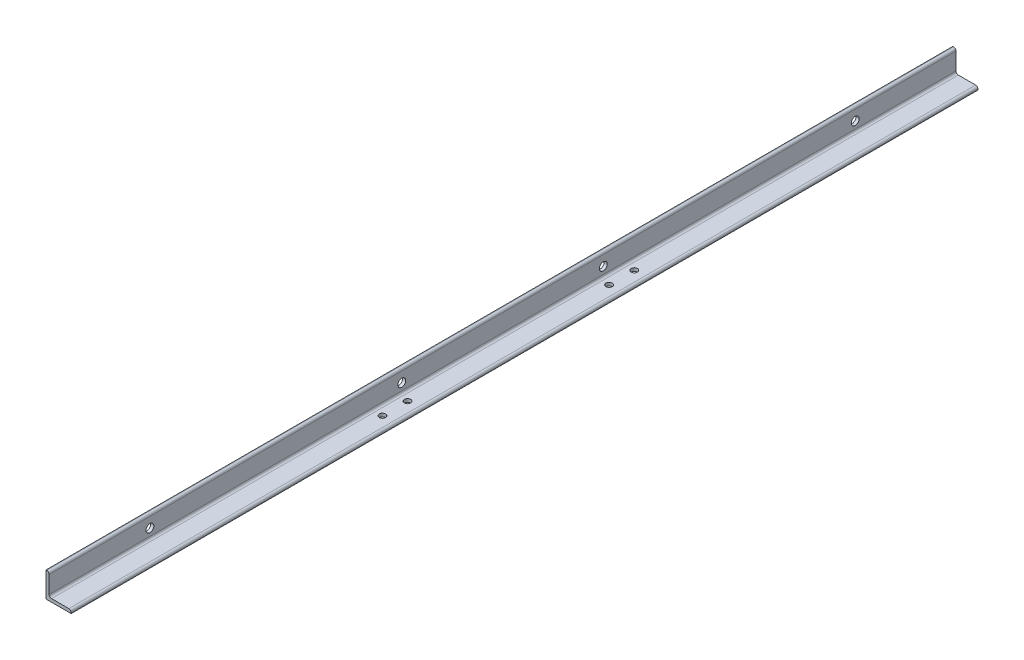
ISO-10303-21;
HEADER;
FILE_DESCRIPTION(('STEP AP214'),'2;1');
FILE_NAME('part.step','',(''),(''),'','','');
FILE_SCHEMA(('AUTOMOTIVE_DESIGN { 1 0 10303 214 1 1 1 1 }'));
ENDSEC;
DATA;
#1=APPLICATION_CONTEXT('core data for automotive mechanical design processes');
#2=APPLICATION_PROTOCOL_DEFINITION('international standard','automotive_design',2000,#1);
#3=PRODUCT_CONTEXT('',#1,'mechanical');
#4=PRODUCT('Part','Part','',(#3));
#5=PRODUCT_RELATED_PRODUCT_CATEGORY('part','',(#4));
#6=PRODUCT_DEFINITION_FORMATION('','',#4);
#7=PRODUCT_DEFINITION_CONTEXT('part definition',#1,'design');
#8=PRODUCT_DEFINITION('design','',#6,#7);
#9=PRODUCT_DEFINITION_SHAPE('','',#8);
#10=(LENGTH_UNIT() NAMED_UNIT(*) SI_UNIT(.MILLI.,.METRE.));
#11=(NAMED_UNIT(*) PLANE_ANGLE_UNIT() SI_UNIT($,.RADIAN.));
#12=(NAMED_UNIT(*) SI_UNIT($,.STERADIAN.) SOLID_ANGLE_UNIT());
#13=UNCERTAINTY_MEASURE_WITH_UNIT(LENGTH_MEASURE(1.E-05),#10,'distance_accuracy_value','');
#14=(GEOMETRIC_REPRESENTATION_CONTEXT(3) GLOBAL_UNCERTAINTY_ASSIGNED_CONTEXT((#13)) GLOBAL_UNIT_ASSIGNED_CONTEXT((#10,
#11,#12)) REPRESENTATION_CONTEXT('',''));
#15=CARTESIAN_POINT('',(0.,0.,0.));
#16=DIRECTION('',(0.,0.,1.));
#17=DIRECTION('',(1.,0.,0.));
#18=AXIS2_PLACEMENT_3D('',#15,#16,#17);
#19=CARTESIAN_POINT('',(0.,0.,914.4));
#20=DIRECTION('',(1.,0.,0.));
#21=DIRECTION('',(0.,1.,0.));
#22=AXIS2_PLACEMENT_3D('',#19,#20,#21);
#23=PLANE('',#22);
#24=CARTESIAN_POINT('',(0.,25.4,711.2));
#25=DIRECTION('',(-1.,0.,0.));
#26=DIRECTION('',(0.,0.,1.));
#27=AXIS2_PLACEMENT_3D('',#24,#25,#26);
#28=CIRCLE('',#27,7.93749999999999);
#29=CARTESIAN_POINT('',(0.,25.4,719.1375));
#30=VERTEX_POINT('',#29);
#31=EDGE_CURVE('E210',#30,#30,#28,.T.);
#32=ORIENTED_EDGE('',*,*,#31,.F.);
#33=EDGE_LOOP('',(#32));
#34=FACE_BOUND('',#33,.T.);
#35=DIRECTION('',(0.,-1.,0.));
#36=VECTOR('',#35,1.);
#37=CARTESIAN_POINT('',(0.,0.,-914.4));
#38=LINE('',#37,#36);
#39=CARTESIAN_POINT('',(0.,50.8,-914.4));
#40=VERTEX_POINT('',#39);
#41=CARTESIAN_POINT('',(0.,0.,-914.4));
#42=VERTEX_POINT('',#41);
#43=EDGE_CURVE('E90',#40,#42,#38,.T.);
#44=ORIENTED_EDGE('',*,*,#43,.T.);
#45=DIRECTION('',(0.,0.,-1.));
#46=VECTOR('',#45,1.);
#47=CARTESIAN_POINT('',(0.,0.,914.4));
#48=LINE('',#47,#46);
#49=CARTESIAN_POINT('',(0.,0.,914.4));
#50=VERTEX_POINT('',#49);
#51=EDGE_CURVE('E134',#50,#42,#48,.T.);
#52=ORIENTED_EDGE('',*,*,#51,.F.);
#53=DIRECTION('',(0.,-1.,0.));
#54=VECTOR('',#53,1.);
#55=CARTESIAN_POINT('',(0.,0.,914.4));
#56=LINE('',#55,#54);
#57=CARTESIAN_POINT('',(0.,50.8,914.4));
#58=VERTEX_POINT('',#57);
#59=EDGE_CURVE('E52',#58,#50,#56,.T.);
#60=ORIENTED_EDGE('',*,*,#59,.F.);
#61=DIRECTION('',(0.,0.,-1.));
#62=VECTOR('',#61,1.);
#63=CARTESIAN_POINT('',(0.,50.8,914.4));
#64=LINE('',#63,#62);
#65=EDGE_CURVE('E130',#58,#40,#64,.T.);
#66=ORIENTED_EDGE('',*,*,#65,.T.);
#67=EDGE_LOOP('',(#44,#52,#60,#66));
#68=FACE_BOUND('',#67,.T.);
#69=CARTESIAN_POINT('',(0.,25.4,203.2));
#70=DIRECTION('',(-1.,0.,0.));
#71=DIRECTION('',(0.,0.,1.));
#72=AXIS2_PLACEMENT_3D('',#69,#70,#71);
#73=CIRCLE('',#72,7.93749999999999);
#74=CARTESIAN_POINT('',(0.,25.4,211.1375));
#75=VERTEX_POINT('',#74);
#76=EDGE_CURVE('E216',#75,#75,#73,.T.);
#77=ORIENTED_EDGE('',*,*,#76,.F.);
#78=EDGE_LOOP('',(#77));
#79=FACE_BOUND('',#78,.T.);
#80=CARTESIAN_POINT('',(0.,25.4,-203.2));
#81=DIRECTION('',(-1.,0.,0.));
#82=DIRECTION('',(0.,0.,1.));
#83=AXIS2_PLACEMENT_3D('',#80,#81,#82);
#84=CIRCLE('',#83,7.93749999999999);
#85=CARTESIAN_POINT('',(0.,25.4,-195.2625));
#86=VERTEX_POINT('',#85);
#87=EDGE_CURVE('E222',#86,#86,#84,.T.);
#88=ORIENTED_EDGE('',*,*,#87,.F.);
#89=EDGE_LOOP('',(#88));
#90=FACE_BOUND('',#89,.T.);
#91=CARTESIAN_POINT('',(0.,25.4,-711.2));
#92=DIRECTION('',(-1.,0.,0.));
#93=DIRECTION('',(0.,0.,1.));
#94=AXIS2_PLACEMENT_3D('',#91,#92,#93);
#95=CIRCLE('',#94,7.93749999999999);
#96=CARTESIAN_POINT('',(0.,25.4,-703.2625));
#97=VERTEX_POINT('',#96);
#98=EDGE_CURVE('E228',#97,#97,#95,.T.);
#99=ORIENTED_EDGE('',*,*,#98,.F.);
#100=EDGE_LOOP('',(#99));
#101=FACE_BOUND('',#100,.T.);
#102=ADVANCED_FACE('F35',(#34,#68,#79,#90,#101),#23,.F.);
#103=CARTESIAN_POINT('',(50.7999999999999,0.,914.4));
#104=DIRECTION('',(0.,1.,0.));
#105=DIRECTION('',(0.,0.,1.));
#106=AXIS2_PLACEMENT_3D('',#103,#104,#105);
#107=PLANE('',#106);
#108=CARTESIAN_POINT('',(25.4,0.,261.366));
#109=DIRECTION('',(0.,1.,0.));
#110=DIRECTION('',(0.,0.,1.));
#111=AXIS2_PLACEMENT_3D('',#108,#109,#110);
#112=CIRCLE('',#111,6.35);
#113=CARTESIAN_POINT('',(25.4,0.,267.716));
#114=VERTEX_POINT('',#113);
#115=EDGE_CURVE('E235',#114,#114,#112,.T.);
#116=ORIENTED_EDGE('',*,*,#115,.T.);
#117=EDGE_LOOP('',(#116));
#118=FACE_BOUND('',#117,.T.);
#119=CARTESIAN_POINT('',(25.4,0.,-246.634));
#120=DIRECTION('',(0.,1.,0.));
#121=DIRECTION('',(0.,0.,1.));
#122=AXIS2_PLACEMENT_3D('',#119,#120,#121);
#123=CIRCLE('',#122,6.35);
#124=CARTESIAN_POINT('',(25.4,0.,-240.284));
#125=VERTEX_POINT('',#124);
#126=EDGE_CURVE('E231',#125,#125,#123,.T.);
#127=ORIENTED_EDGE('',*,*,#126,.T.);
#128=EDGE_LOOP('',(#127));
#129=FACE_BOUND('',#128,.T.);
#130=CARTESIAN_POINT('',(25.4,0.,-195.834));
#131=DIRECTION('',(0.,-1.,0.));
#132=DIRECTION('',(0.,0.,-1.));
#133=AXIS2_PLACEMENT_3D('',#130,#131,#132);
#134=CIRCLE('',#133,6.35);
#135=CARTESIAN_POINT('',(25.4,0.,-202.184));
#136=VERTEX_POINT('',#135);
#137=EDGE_CURVE('E204',#136,#136,#134,.T.);
#138=ORIENTED_EDGE('',*,*,#137,.F.);
#139=EDGE_LOOP('',(#138));
#140=FACE_BOUND('',#139,.T.);
#141=CARTESIAN_POINT('',(25.4,0.,210.566));
#142=DIRECTION('',(0.,-1.,0.));
#143=DIRECTION('',(0.,0.,-1.));
#144=AXIS2_PLACEMENT_3D('',#141,#142,#143);
#145=CIRCLE('',#144,6.35);
#146=CARTESIAN_POINT('',(25.4,0.,204.216));
#147=VERTEX_POINT('',#146);
#148=EDGE_CURVE('E198',#147,#147,#145,.T.);
#149=ORIENTED_EDGE('',*,*,#148,.F.);
#150=EDGE_LOOP('',(#149));
#151=FACE_BOUND('',#150,.T.);
#152=DIRECTION('',(1.,0.,0.));
#153=VECTOR('',#152,1.);
#154=CARTESIAN_POINT('',(50.7999999999999,0.,-914.4));
#155=LINE('',#154,#153);
#156=CARTESIAN_POINT('',(50.7999999999999,0.,-914.4));
#157=VERTEX_POINT('',#156);
#158=EDGE_CURVE('E138',#42,#157,#155,.T.);
#159=ORIENTED_EDGE('',*,*,#158,.T.);
#160=DIRECTION('',(0.,0.,-1.));
#161=VECTOR('',#160,1.);
#162=CARTESIAN_POINT('',(50.7999999999999,0.,914.4));
#163=LINE('',#162,#161);
#164=CARTESIAN_POINT('',(50.7999999999999,0.,914.4));
#165=VERTEX_POINT('',#164);
#166=EDGE_CURVE('E11',#165,#157,#163,.T.);
#167=ORIENTED_EDGE('',*,*,#166,.F.);
#168=DIRECTION('',(1.,0.,0.));
#169=VECTOR('',#168,1.);
#170=CARTESIAN_POINT('',(50.7999999999999,0.,914.4));
#171=LINE('',#170,#169);
#172=EDGE_CURVE('E155',#50,#165,#171,.T.);
#173=ORIENTED_EDGE('',*,*,#172,.F.);
#174=ORIENTED_EDGE('',*,*,#51,.T.);
#175=EDGE_LOOP('',(#159,#167,#173,#174));
#176=FACE_BOUND('',#175,.T.);
#177=ADVANCED_FACE('F37',(#118,#129,#140,#151,#176),#107,.F.);
#178=CARTESIAN_POINT('',(50.7999999999999,1.59258,914.4));
#179=DIRECTION('',(-1.,0.,0.));
#180=DIRECTION('',(0.,0.,1.));
#181=AXIS2_PLACEMENT_3D('',#178,#179,#180);
#182=PLANE('',#181);
#183=DIRECTION('',(0.,1.,0.));
#184=VECTOR('',#183,1.);
#185=CARTESIAN_POINT('',(50.7999999999999,1.59258,-914.4));
#186=LINE('',#185,#184);
#187=CARTESIAN_POINT('',(50.7999999999999,1.59258,-914.4));
#188=VERTEX_POINT('',#187);
#189=EDGE_CURVE('E141',#157,#188,#186,.T.);
#190=ORIENTED_EDGE('',*,*,#189,.T.);
#191=DIRECTION('',(0.,0.,-1.));
#192=VECTOR('',#191,1.);
#193=CARTESIAN_POINT('',(50.7999999999999,1.59258,914.4));
#194=LINE('',#193,#192);
#195=CARTESIAN_POINT('',(50.7999999999999,1.59258,914.4));
#196=VERTEX_POINT('',#195);
#197=EDGE_CURVE('E44',#196,#188,#194,.T.);
#198=ORIENTED_EDGE('',*,*,#197,.F.);
#199=DIRECTION('',(0.,1.,0.));
#200=VECTOR('',#199,1.);
#201=CARTESIAN_POINT('',(50.7999999999999,1.59258,914.4));
#202=LINE('',#201,#200);
#203=EDGE_CURVE('E98',#165,#196,#202,.T.);
#204=ORIENTED_EDGE('',*,*,#203,.F.);
#205=ORIENTED_EDGE('',*,*,#166,.T.);
#206=EDGE_LOOP('',(#190,#198,#204,#205));
#207=FACE_BOUND('',#206,.T.);
#208=ADVANCED_FACE('F271',(#207),#182,.F.);
#209=CARTESIAN_POINT('',(46.0425799999999,1.59258,914.4));
#210=DIRECTION('',(0.,0.,-1.));
#211=DIRECTION('',(-1.,0.,0.));
#212=AXIS2_PLACEMENT_3D('',#209,#210,#211);
#213=CYLINDRICAL_SURFACE('',#212,4.75742);
#214=CARTESIAN_POINT('',(46.0425799999999,1.59258,-914.4));
#215=DIRECTION('',(0.,0.,1.));
#216=DIRECTION('',(1.,0.,0.));
#217=AXIS2_PLACEMENT_3D('',#214,#215,#216);
#218=CIRCLE('',#217,4.75742);
#219=CARTESIAN_POINT('',(46.0425799999999,6.34999999999999,-914.4));
#220=VERTEX_POINT('',#219);
#221=EDGE_CURVE('E144',#188,#220,#218,.T.);
#222=ORIENTED_EDGE('',*,*,#221,.T.);
#223=DIRECTION('',(0.,0.,-1.));
#224=VECTOR('',#223,1.);
#225=CARTESIAN_POINT('',(46.0425799999999,6.34999999999999,914.4));
#226=LINE('',#225,#224);
#227=CARTESIAN_POINT('',(46.0425799999999,6.34999999999999,914.4));
#228=VERTEX_POINT('',#227);
#229=EDGE_CURVE('E165',#228,#220,#226,.T.);
#230=ORIENTED_EDGE('',*,*,#229,.F.);
#231=CARTESIAN_POINT('',(46.0425799999999,1.59258,914.4));
#232=DIRECTION('',(0.,0.,1.));
#233=DIRECTION('',(1.,0.,0.));
#234=AXIS2_PLACEMENT_3D('',#231,#232,#233);
#235=CIRCLE('',#234,4.75742);
#236=EDGE_CURVE('E173',#196,#228,#235,.T.);
#237=ORIENTED_EDGE('',*,*,#236,.F.);
#238=ORIENTED_EDGE('',*,*,#197,.T.);
#239=EDGE_LOOP('',(#222,#230,#237,#238));
#240=FACE_BOUND('',#239,.T.);
#241=ADVANCED_FACE('F171',(#240),#213,.T.);
#242=CARTESIAN_POINT('',(11.1125,6.34999999999999,914.4));
#243=DIRECTION('',(0.,-1.,0.));
#244=DIRECTION('',(0.,0.,-1.));
#245=AXIS2_PLACEMENT_3D('',#242,#243,#244);
#246=PLANE('',#245);
#247=CARTESIAN_POINT('',(25.4,6.34999999999999,261.366));
#248=DIRECTION('',(0.,1.,0.));
#249=DIRECTION('',(0.,0.,1.));
#250=AXIS2_PLACEMENT_3D('',#247,#248,#249);
#251=CIRCLE('',#250,6.35);
#252=CARTESIAN_POINT('',(25.4,6.34999999999999,267.716));
#253=VERTEX_POINT('',#252);
#254=EDGE_CURVE('E238',#253,#253,#251,.T.);
#255=ORIENTED_EDGE('',*,*,#254,.F.);
#256=EDGE_LOOP('',(#255));
#257=FACE_BOUND('',#256,.T.);
#258=CARTESIAN_POINT('',(25.4,6.34999999999999,-246.634));
#259=DIRECTION('',(0.,1.,0.));
#260=DIRECTION('',(0.,0.,1.));
#261=AXIS2_PLACEMENT_3D('',#258,#259,#260);
#262=CIRCLE('',#261,6.35);
#263=CARTESIAN_POINT('',(25.4,6.34999999999999,-240.284));
#264=VERTEX_POINT('',#263);
#265=EDGE_CURVE('E232',#264,#264,#262,.T.);
#266=ORIENTED_EDGE('',*,*,#265,.F.);
#267=EDGE_LOOP('',(#266));
#268=FACE_BOUND('',#267,.T.);
#269=CARTESIAN_POINT('',(25.4,6.34999999999999,-195.834));
#270=DIRECTION('',(0.,-1.,0.));
#271=DIRECTION('',(0.,0.,-1.));
#272=AXIS2_PLACEMENT_3D('',#269,#270,#271);
#273=CIRCLE('',#272,6.35);
#274=CARTESIAN_POINT('',(25.4,6.34999999999999,-202.184));
#275=VERTEX_POINT('',#274);
#276=EDGE_CURVE('E201',#275,#275,#273,.T.);
#277=ORIENTED_EDGE('',*,*,#276,.T.);
#278=EDGE_LOOP('',(#277));
#279=FACE_BOUND('',#278,.T.);
#280=CARTESIAN_POINT('',(25.4,6.34999999999999,210.566));
#281=DIRECTION('',(0.,-1.,0.));
#282=DIRECTION('',(0.,0.,-1.));
#283=AXIS2_PLACEMENT_3D('',#280,#281,#282);
#284=CIRCLE('',#283,6.35);
#285=CARTESIAN_POINT('',(25.4,6.34999999999999,204.216));
#286=VERTEX_POINT('',#285);
#287=EDGE_CURVE('E142',#286,#286,#284,.T.);
#288=ORIENTED_EDGE('',*,*,#287,.T.);
#289=EDGE_LOOP('',(#288));
#290=FACE_BOUND('',#289,.T.);
#291=DIRECTION('',(-1.,0.,0.));
#292=VECTOR('',#291,1.);
#293=CARTESIAN_POINT('',(11.1125,6.34999999999999,-914.4));
#294=LINE('',#293,#292);
#295=CARTESIAN_POINT('',(11.1125,6.34999999999999,-914.4));
#296=VERTEX_POINT('',#295);
#297=EDGE_CURVE('E146',#220,#296,#294,.T.);
#298=ORIENTED_EDGE('',*,*,#297,.T.);
#299=DIRECTION('',(0.,0.,-1.));
#300=VECTOR('',#299,1.);
#301=CARTESIAN_POINT('',(11.1125,6.34999999999999,914.4));
#302=LINE('',#301,#300);
#303=CARTESIAN_POINT('',(11.1125,6.34999999999999,914.4));
#304=VERTEX_POINT('',#303);
#305=EDGE_CURVE('E162',#304,#296,#302,.T.);
#306=ORIENTED_EDGE('',*,*,#305,.F.);
#307=DIRECTION('',(-1.,0.,0.));
#308=VECTOR('',#307,1.);
#309=CARTESIAN_POINT('',(11.1125,6.34999999999999,914.4));
#310=LINE('',#309,#308);
#311=EDGE_CURVE('E189',#228,#304,#310,.T.);
#312=ORIENTED_EDGE('',*,*,#311,.F.);
#313=ORIENTED_EDGE('',*,*,#229,.T.);
#314=EDGE_LOOP('',(#298,#306,#312,#313));
#315=FACE_BOUND('',#314,.T.);
#316=ADVANCED_FACE('F182',(#257,#268,#279,#290,#315),#246,.F.);
#317=CARTESIAN_POINT('',(11.1125,11.1125,914.4));
#318=DIRECTION('',(0.,0.,-1.));
#319=DIRECTION('',(-1.,0.,0.));
#320=AXIS2_PLACEMENT_3D('',#317,#318,#319);
#321=CYLINDRICAL_SURFACE('',#320,4.7625);
#322=CARTESIAN_POINT('',(11.1125,11.1125,-914.4));
#323=DIRECTION('',(0.,0.,-1.));
#324=DIRECTION('',(-1.,0.,0.));
#325=AXIS2_PLACEMENT_3D('',#322,#323,#324);
#326=CIRCLE('',#325,4.7625);
#327=CARTESIAN_POINT('',(6.35,11.1125,-914.4));
#328=VERTEX_POINT('',#327);
#329=EDGE_CURVE('E148',#296,#328,#326,.T.);
#330=ORIENTED_EDGE('',*,*,#329,.T.);
#331=DIRECTION('',(0.,0.,-1.));
#332=VECTOR('',#331,1.);
#333=CARTESIAN_POINT('',(6.35,11.1125,914.4));
#334=LINE('',#333,#332);
#335=CARTESIAN_POINT('',(6.35,11.1125,914.4));
#336=VERTEX_POINT('',#335);
#337=EDGE_CURVE('E159',#336,#328,#334,.T.);
#338=ORIENTED_EDGE('',*,*,#337,.F.);
#339=CARTESIAN_POINT('',(11.1125,11.1125,914.4));
#340=DIRECTION('',(0.,0.,-1.));
#341=DIRECTION('',(-1.,0.,0.));
#342=AXIS2_PLACEMENT_3D('',#339,#340,#341);
#343=CIRCLE('',#342,4.7625);
#344=EDGE_CURVE('E188',#304,#336,#343,.T.);
#345=ORIENTED_EDGE('',*,*,#344,.F.);
#346=ORIENTED_EDGE('',*,*,#305,.T.);
#347=EDGE_LOOP('',(#330,#338,#345,#346));
#348=FACE_BOUND('',#347,.T.);
#349=ADVANCED_FACE('F186',(#348),#321,.F.);
#350=CARTESIAN_POINT('',(6.35,46.04258,914.4));
#351=DIRECTION('',(-1.,0.,0.));
#352=DIRECTION('',(0.,-1.,0.));
#353=AXIS2_PLACEMENT_3D('',#350,#351,#352);
#354=PLANE('',#353);
#355=CARTESIAN_POINT('',(6.35,25.4,-711.2));
#356=DIRECTION('',(-1.,0.,0.));
#357=DIRECTION('',(0.,-1.,0.));
#358=AXIS2_PLACEMENT_3D('',#355,#356,#357);
#359=CIRCLE('',#358,7.93749999999999);
#360=CARTESIAN_POINT('',(6.35,17.4625,-711.2));
#361=VERTEX_POINT('',#360);
#362=EDGE_CURVE('E225',#361,#361,#359,.T.);
#363=ORIENTED_EDGE('',*,*,#362,.T.);
#364=EDGE_LOOP('',(#363));
#365=FACE_BOUND('',#364,.T.);
#366=CARTESIAN_POINT('',(6.35,25.4,-203.2));
#367=DIRECTION('',(-1.,0.,0.));
#368=DIRECTION('',(0.,-1.,0.));
#369=AXIS2_PLACEMENT_3D('',#366,#367,#368);
#370=CIRCLE('',#369,7.93749999999999);
#371=CARTESIAN_POINT('',(6.35,17.4625,-203.2));
#372=VERTEX_POINT('',#371);
#373=EDGE_CURVE('E219',#372,#372,#370,.T.);
#374=ORIENTED_EDGE('',*,*,#373,.T.);
#375=EDGE_LOOP('',(#374));
#376=FACE_BOUND('',#375,.T.);
#377=CARTESIAN_POINT('',(6.35,25.4,203.2));
#378=DIRECTION('',(-1.,0.,0.));
#379=DIRECTION('',(0.,-1.,0.));
#380=AXIS2_PLACEMENT_3D('',#377,#378,#379);
#381=CIRCLE('',#380,7.93749999999999);
#382=CARTESIAN_POINT('',(6.35,17.4625,203.2));
#383=VERTEX_POINT('',#382);
#384=EDGE_CURVE('E213',#383,#383,#381,.T.);
#385=ORIENTED_EDGE('',*,*,#384,.T.);
#386=EDGE_LOOP('',(#385));
#387=FACE_BOUND('',#386,.T.);
#388=CARTESIAN_POINT('',(6.35,25.4,711.2));
#389=DIRECTION('',(-1.,0.,0.));
#390=DIRECTION('',(0.,-1.,0.));
#391=AXIS2_PLACEMENT_3D('',#388,#389,#390);
#392=CIRCLE('',#391,7.93749999999999);
#393=CARTESIAN_POINT('',(6.35,17.4625,711.2));
#394=VERTEX_POINT('',#393);
#395=EDGE_CURVE('E207',#394,#394,#392,.T.);
#396=ORIENTED_EDGE('',*,*,#395,.T.);
#397=EDGE_LOOP('',(#396));
#398=FACE_BOUND('',#397,.T.);
#399=DIRECTION('',(0.,1.,0.));
#400=VECTOR('',#399,1.);
#401=CARTESIAN_POINT('',(6.35,46.04258,-914.4));
#402=LINE('',#401,#400);
#403=CARTESIAN_POINT('',(6.35,46.04258,-914.4));
#404=VERTEX_POINT('',#403);
#405=EDGE_CURVE('E150',#328,#404,#402,.T.);
#406=ORIENTED_EDGE('',*,*,#405,.T.);
#407=DIRECTION('',(0.,0.,-1.));
#408=VECTOR('',#407,1.);
#409=CARTESIAN_POINT('',(6.35,46.04258,914.4));
#410=LINE('',#409,#408);
#411=CARTESIAN_POINT('',(6.35,46.04258,914.4));
#412=VERTEX_POINT('',#411);
#413=EDGE_CURVE('E129',#412,#404,#410,.T.);
#414=ORIENTED_EDGE('',*,*,#413,.F.);
#415=DIRECTION('',(0.,1.,0.));
#416=VECTOR('',#415,1.);
#417=CARTESIAN_POINT('',(6.35,46.04258,914.4));
#418=LINE('',#417,#416);
#419=EDGE_CURVE('E120',#336,#412,#418,.T.);
#420=ORIENTED_EDGE('',*,*,#419,.F.);
#421=ORIENTED_EDGE('',*,*,#337,.T.);
#422=EDGE_LOOP('',(#406,#414,#420,#421));
#423=FACE_BOUND('',#422,.T.);
#424=ADVANCED_FACE('F275',(#365,#376,#387,#398,#423),#354,.F.);
#425=CARTESIAN_POINT('',(1.59258,46.04258,914.4));
#426=DIRECTION('',(0.,0.,-1.));
#427=DIRECTION('',(-1.,0.,0.));
#428=AXIS2_PLACEMENT_3D('',#425,#426,#427);
#429=CYLINDRICAL_SURFACE('',#428,4.75742);
#430=CARTESIAN_POINT('',(1.59258,46.04258,-914.4));
#431=DIRECTION('',(0.,0.,1.));
#432=DIRECTION('',(-1.,0.,0.));
#433=AXIS2_PLACEMENT_3D('',#430,#431,#432);
#434=CIRCLE('',#433,4.75742);
#435=CARTESIAN_POINT('',(1.59258,50.8,-914.4));
#436=VERTEX_POINT('',#435);
#437=EDGE_CURVE('E128',#404,#436,#434,.T.);
#438=ORIENTED_EDGE('',*,*,#437,.T.);
#439=DIRECTION('',(0.,0.,-1.));
#440=VECTOR('',#439,1.);
#441=CARTESIAN_POINT('',(1.59258,50.8,914.4));
#442=LINE('',#441,#440);
#443=CARTESIAN_POINT('',(1.59258,50.8,914.4));
#444=VERTEX_POINT('',#443);
#445=EDGE_CURVE('E125',#444,#436,#442,.T.);
#446=ORIENTED_EDGE('',*,*,#445,.F.);
#447=CARTESIAN_POINT('',(1.59258,46.04258,914.4));
#448=DIRECTION('',(0.,0.,1.));
#449=DIRECTION('',(-1.,0.,0.));
#450=AXIS2_PLACEMENT_3D('',#447,#448,#449);
#451=CIRCLE('',#450,4.75742);
#452=EDGE_CURVE('E114',#412,#444,#451,.T.);
#453=ORIENTED_EDGE('',*,*,#452,.F.);
#454=ORIENTED_EDGE('',*,*,#413,.T.);
#455=EDGE_LOOP('',(#438,#446,#453,#454));
#456=FACE_BOUND('',#455,.T.);
#457=ADVANCED_FACE('F126',(#456),#429,.T.);
#458=CARTESIAN_POINT('',(0.,50.8,914.4));
#459=DIRECTION('',(0.,-1.,0.));
#460=DIRECTION('',(0.,0.,-1.));
#461=AXIS2_PLACEMENT_3D('',#458,#459,#460);
#462=PLANE('',#461);
#463=DIRECTION('',(-1.,0.,0.));
#464=VECTOR('',#463,1.);
#465=CARTESIAN_POINT('',(0.,50.8,-914.4));
#466=LINE('',#465,#464);
#467=EDGE_CURVE('E84',#436,#40,#466,.T.);
#468=ORIENTED_EDGE('',*,*,#467,.T.);
#469=ORIENTED_EDGE('',*,*,#65,.F.);
#470=DIRECTION('',(-1.,0.,0.));
#471=VECTOR('',#470,1.);
#472=CARTESIAN_POINT('',(0.,50.8,914.4));
#473=LINE('',#472,#471);
#474=EDGE_CURVE('E118',#444,#58,#473,.T.);
#475=ORIENTED_EDGE('',*,*,#474,.F.);
#476=ORIENTED_EDGE('',*,*,#445,.T.);
#477=EDGE_LOOP('',(#468,#469,#475,#476));
#478=FACE_BOUND('',#477,.T.);
#479=ADVANCED_FACE('F132',(#478),#462,.F.);
#480=CARTESIAN_POINT('',(1.59258,46.04258,914.4));
#481=DIRECTION('',(0.,0.,-1.));
#482=DIRECTION('',(-1.,0.,0.));
#483=AXIS2_PLACEMENT_3D('',#480,#481,#482);
#484=PLANE('',#483);
#485=ORIENTED_EDGE('',*,*,#172,.T.);
#486=ORIENTED_EDGE('',*,*,#203,.T.);
#487=ORIENTED_EDGE('',*,*,#236,.T.);
#488=ORIENTED_EDGE('',*,*,#311,.T.);
#489=ORIENTED_EDGE('',*,*,#344,.T.);
#490=ORIENTED_EDGE('',*,*,#419,.T.);
#491=ORIENTED_EDGE('',*,*,#452,.T.);
#492=ORIENTED_EDGE('',*,*,#474,.T.);
#493=ORIENTED_EDGE('',*,*,#59,.T.);
#494=EDGE_LOOP('',(#485,#486,#487,#488,#489,#490,#491,#492,#493));
#495=FACE_BOUND('',#494,.T.);
#496=ADVANCED_FACE('F116',(#495),#484,.F.);
#497=CARTESIAN_POINT('',(1.59258,46.04258,-914.4));
#498=DIRECTION('',(0.,0.,-1.));
#499=DIRECTION('',(-1.,0.,0.));
#500=AXIS2_PLACEMENT_3D('',#497,#498,#499);
#501=PLANE('',#500);
#502=ORIENTED_EDGE('',*,*,#158,.F.);
#503=ORIENTED_EDGE('',*,*,#43,.F.);
#504=ORIENTED_EDGE('',*,*,#467,.F.);
#505=ORIENTED_EDGE('',*,*,#437,.F.);
#506=ORIENTED_EDGE('',*,*,#405,.F.);
#507=ORIENTED_EDGE('',*,*,#329,.F.);
#508=ORIENTED_EDGE('',*,*,#297,.F.);
#509=ORIENTED_EDGE('',*,*,#221,.F.);
#510=ORIENTED_EDGE('',*,*,#189,.F.);
#511=EDGE_LOOP('',(#502,#503,#504,#505,#506,#507,#508,#509,#510));
#512=FACE_BOUND('',#511,.T.);
#513=ADVANCED_FACE('F177',(#512),#501,.T.);
#514=CARTESIAN_POINT('',(25.4,0.,210.566));
#515=DIRECTION('',(0.,-1.,0.));
#516=DIRECTION('',(0.,0.,-1.));
#517=AXIS2_PLACEMENT_3D('',#514,#515,#516);
#518=CYLINDRICAL_SURFACE('',#517,6.35);
#519=ORIENTED_EDGE('',*,*,#287,.F.);
#520=EDGE_LOOP('',(#519));
#521=FACE_BOUND('',#520,.T.);
#522=ORIENTED_EDGE('',*,*,#148,.T.);
#523=EDGE_LOOP('',(#522));
#524=FACE_BOUND('',#523,.T.);
#525=ADVANCED_FACE('F262',(#521,#524),#518,.F.);
#526=CARTESIAN_POINT('',(25.4,0.,-195.834));
#527=DIRECTION('',(0.,-1.,0.));
#528=DIRECTION('',(0.,0.,-1.));
#529=AXIS2_PLACEMENT_3D('',#526,#527,#528);
#530=CYLINDRICAL_SURFACE('',#529,6.35);
#531=ORIENTED_EDGE('',*,*,#276,.F.);
#532=EDGE_LOOP('',(#531));
#533=FACE_BOUND('',#532,.T.);
#534=ORIENTED_EDGE('',*,*,#137,.T.);
#535=EDGE_LOOP('',(#534));
#536=FACE_BOUND('',#535,.T.);
#537=ADVANCED_FACE('F265',(#533,#536),#530,.F.);
#538=CARTESIAN_POINT('',(0.,25.4,711.2));
#539=DIRECTION('',(-1.,0.,0.));
#540=DIRECTION('',(0.,0.,1.));
#541=AXIS2_PLACEMENT_3D('',#538,#539,#540);
#542=CYLINDRICAL_SURFACE('',#541,7.93749999999999);
#543=ORIENTED_EDGE('',*,*,#395,.F.);
#544=EDGE_LOOP('',(#543));
#545=FACE_BOUND('',#544,.T.);
#546=ORIENTED_EDGE('',*,*,#31,.T.);
#547=EDGE_LOOP('',(#546));
#548=FACE_BOUND('',#547,.T.);
#549=ADVANCED_FACE('F305',(#545,#548),#542,.F.);
#550=CARTESIAN_POINT('',(0.,25.4,203.2));
#551=DIRECTION('',(-1.,0.,0.));
#552=DIRECTION('',(0.,0.,1.));
#553=AXIS2_PLACEMENT_3D('',#550,#551,#552);
#554=CYLINDRICAL_SURFACE('',#553,7.93749999999999);
#555=ORIENTED_EDGE('',*,*,#384,.F.);
#556=EDGE_LOOP('',(#555));
#557=FACE_BOUND('',#556,.T.);
#558=ORIENTED_EDGE('',*,*,#76,.T.);
#559=EDGE_LOOP('',(#558));
#560=FACE_BOUND('',#559,.T.);
#561=ADVANCED_FACE('F309',(#557,#560),#554,.F.);
#562=CARTESIAN_POINT('',(0.,25.4,-203.2));
#563=DIRECTION('',(-1.,0.,0.));
#564=DIRECTION('',(0.,0.,1.));
#565=AXIS2_PLACEMENT_3D('',#562,#563,#564);
#566=CYLINDRICAL_SURFACE('',#565,7.93749999999999);
#567=ORIENTED_EDGE('',*,*,#373,.F.);
#568=EDGE_LOOP('',(#567));
#569=FACE_BOUND('',#568,.T.);
#570=ORIENTED_EDGE('',*,*,#87,.T.);
#571=EDGE_LOOP('',(#570));
#572=FACE_BOUND('',#571,.T.);
#573=ADVANCED_FACE('F313',(#569,#572),#566,.F.);
#574=CARTESIAN_POINT('',(0.,25.4,-711.2));
#575=DIRECTION('',(-1.,0.,0.));
#576=DIRECTION('',(0.,0.,1.));
#577=AXIS2_PLACEMENT_3D('',#574,#575,#576);
#578=CYLINDRICAL_SURFACE('',#577,7.93749999999999);
#579=ORIENTED_EDGE('',*,*,#362,.F.);
#580=EDGE_LOOP('',(#579));
#581=FACE_BOUND('',#580,.T.);
#582=ORIENTED_EDGE('',*,*,#98,.T.);
#583=EDGE_LOOP('',(#582));
#584=FACE_BOUND('',#583,.T.);
#585=ADVANCED_FACE('F317',(#581,#584),#578,.F.);
#586=CARTESIAN_POINT('',(25.4,0.,-246.634));
#587=DIRECTION('',(0.,1.,0.));
#588=DIRECTION('',(0.,0.,1.));
#589=AXIS2_PLACEMENT_3D('',#586,#587,#588);
#590=CYLINDRICAL_SURFACE('',#589,6.35);
#591=ORIENTED_EDGE('',*,*,#126,.F.);
#592=EDGE_LOOP('',(#591));
#593=FACE_BOUND('',#592,.T.);
#594=ORIENTED_EDGE('',*,*,#265,.T.);
#595=EDGE_LOOP('',(#594));
#596=FACE_BOUND('',#595,.T.);
#597=ADVANCED_FACE('F249',(#593,#596),#590,.F.);
#598=CARTESIAN_POINT('',(25.4,0.,261.366));
#599=DIRECTION('',(0.,1.,0.));
#600=DIRECTION('',(0.,0.,1.));
#601=AXIS2_PLACEMENT_3D('',#598,#599,#600);
#602=CYLINDRICAL_SURFACE('',#601,6.35);
#603=ORIENTED_EDGE('',*,*,#115,.F.);
#604=EDGE_LOOP('',(#603));
#605=FACE_BOUND('',#604,.T.);
#606=ORIENTED_EDGE('',*,*,#254,.T.);
#607=EDGE_LOOP('',(#606));
#608=FACE_BOUND('',#607,.T.);
#609=ADVANCED_FACE('F246',(#605,#608),#602,.F.);
#610=CLOSED_SHELL('',(#102,#177,#208,#241,#316,#349,#424,#457,#479,#496,#513,#525,#537,#549,
#561,#573,#585,#597,#609));
#611=MANIFOLD_SOLID_BREP('B2',#610);
#612=ADVANCED_BREP_SHAPE_REPRESENTATION('',(#18,#611),#14);
#613=SHAPE_DEFINITION_REPRESENTATION(#9,#612);
ENDSEC;
END-ISO-10303-21;
